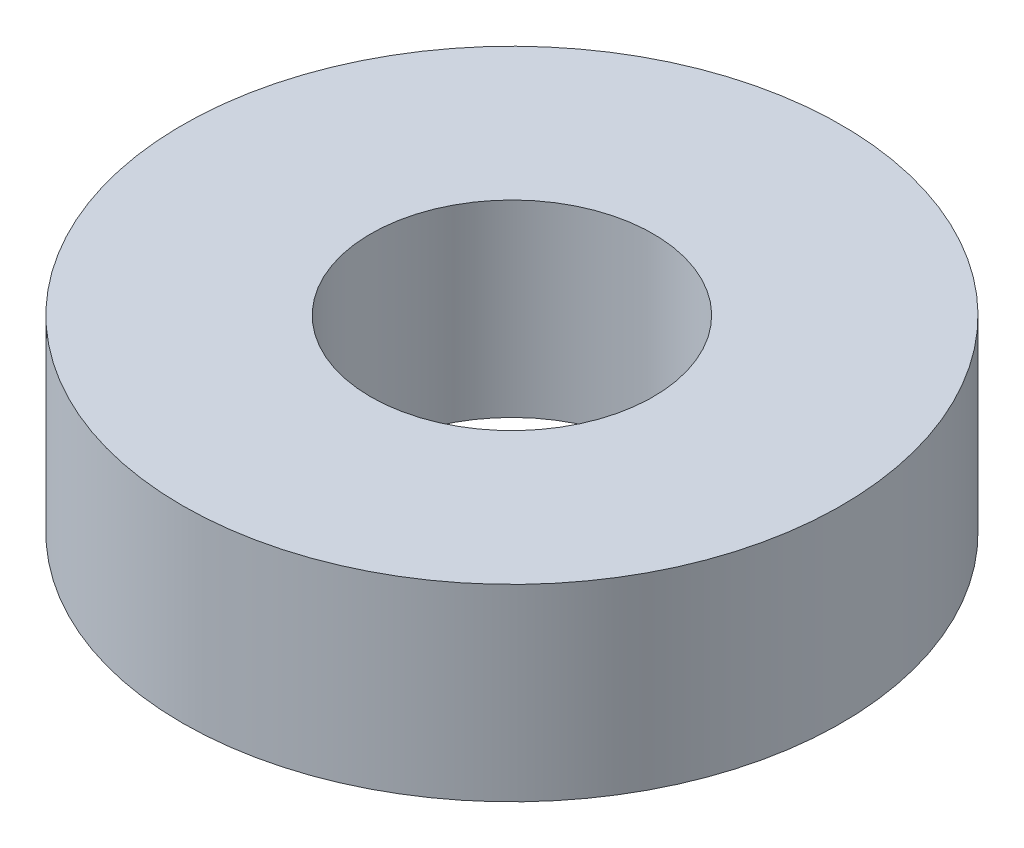
ISO-10303-21;
HEADER;
FILE_DESCRIPTION(('STEP AP214'),'2;1');
FILE_NAME('part.step','',(''),(''),'','','');
FILE_SCHEMA(('AUTOMOTIVE_DESIGN { 1 0 10303 214 1 1 1 1 }'));
ENDSEC;
DATA;
#1=APPLICATION_CONTEXT('core data for automotive mechanical design processes');
#2=APPLICATION_PROTOCOL_DEFINITION('international standard','automotive_design',2000,#1);
#3=PRODUCT_CONTEXT('',#1,'mechanical');
#4=PRODUCT('Part','Part','',(#3));
#5=PRODUCT_RELATED_PRODUCT_CATEGORY('part','',(#4));
#6=PRODUCT_DEFINITION_FORMATION('','',#4);
#7=PRODUCT_DEFINITION_CONTEXT('part definition',#1,'design');
#8=PRODUCT_DEFINITION('design','',#6,#7);
#9=PRODUCT_DEFINITION_SHAPE('','',#8);
#10=(LENGTH_UNIT() NAMED_UNIT(*) SI_UNIT(.MILLI.,.METRE.));
#11=(NAMED_UNIT(*) PLANE_ANGLE_UNIT() SI_UNIT($,.RADIAN.));
#12=(NAMED_UNIT(*) SI_UNIT($,.STERADIAN.) SOLID_ANGLE_UNIT());
#13=UNCERTAINTY_MEASURE_WITH_UNIT(LENGTH_MEASURE(1.E-05),#10,'distance_accuracy_value','');
#14=(GEOMETRIC_REPRESENTATION_CONTEXT(3) GLOBAL_UNCERTAINTY_ASSIGNED_CONTEXT((#13)) GLOBAL_UNIT_ASSIGNED_CONTEXT((#10,
#11,#12)) REPRESENTATION_CONTEXT('',''));
#15=CARTESIAN_POINT('',(0.,0.,0.));
#16=DIRECTION('',(0.,0.,1.));
#17=DIRECTION('',(1.,0.,0.));
#18=AXIS2_PLACEMENT_3D('',#15,#16,#17);
#19=CARTESIAN_POINT('',(0.,0.5,0.));
#20=DIRECTION('',(0.,1.,0.));
#21=DIRECTION('',(0.,0.,1.));
#22=AXIS2_PLACEMENT_3D('',#19,#20,#21);
#23=PLANE('',#22);
#24=CARTESIAN_POINT('',(0.,0.5,0.));
#25=DIRECTION('',(0.,1.,0.));
#26=DIRECTION('',(0.,0.,1.));
#27=AXIS2_PLACEMENT_3D('',#24,#25,#26);
#28=CIRCLE('',#27,0.875);
#29=CARTESIAN_POINT('',(0.,0.5,0.875));
#30=VERTEX_POINT('',#29);
#31=EDGE_CURVE('E10',#30,#30,#28,.T.);
#32=ORIENTED_EDGE('',*,*,#31,.T.);
#33=EDGE_LOOP('',(#32));
#34=FACE_BOUND('',#33,.T.);
#35=CARTESIAN_POINT('',(0.,0.5,0.));
#36=DIRECTION('',(0.,1.,0.));
#37=DIRECTION('',(0.,0.,1.));
#38=AXIS2_PLACEMENT_3D('',#35,#36,#37);
#39=CIRCLE('',#38,0.375);
#40=CARTESIAN_POINT('',(0.,0.5,0.375));
#41=VERTEX_POINT('',#40);
#42=EDGE_CURVE('E42',#41,#41,#39,.T.);
#43=ORIENTED_EDGE('',*,*,#42,.F.);
#44=EDGE_LOOP('',(#43));
#45=FACE_BOUND('',#44,.T.);
#46=ADVANCED_FACE('F31',(#34,#45),#23,.T.);
#47=CARTESIAN_POINT('',(0.,0.,0.));
#48=DIRECTION('',(0.,1.,0.));
#49=DIRECTION('',(0.,0.,1.));
#50=AXIS2_PLACEMENT_3D('',#47,#48,#49);
#51=PLANE('',#50);
#52=CARTESIAN_POINT('',(0.,0.,0.));
#53=DIRECTION('',(0.,1.,0.));
#54=DIRECTION('',(0.,0.,1.));
#55=AXIS2_PLACEMENT_3D('',#52,#53,#54);
#56=CIRCLE('',#55,0.875);
#57=CARTESIAN_POINT('',(0.,0.,0.875));
#58=VERTEX_POINT('',#57);
#59=EDGE_CURVE('E35',#58,#58,#56,.T.);
#60=ORIENTED_EDGE('',*,*,#59,.F.);
#61=EDGE_LOOP('',(#60));
#62=FACE_BOUND('',#61,.T.);
#63=CARTESIAN_POINT('',(0.,0.,0.));
#64=DIRECTION('',(0.,1.,0.));
#65=DIRECTION('',(0.,0.,1.));
#66=AXIS2_PLACEMENT_3D('',#63,#64,#65);
#67=CIRCLE('',#66,0.375);
#68=CARTESIAN_POINT('',(0.,0.,0.375));
#69=VERTEX_POINT('',#68);
#70=EDGE_CURVE('E44',#69,#69,#67,.T.);
#71=ORIENTED_EDGE('',*,*,#70,.T.);
#72=EDGE_LOOP('',(#71));
#73=FACE_BOUND('',#72,.T.);
#74=ADVANCED_FACE('F54',(#62,#73),#51,.F.);
#75=CARTESIAN_POINT('',(0.,0.5,0.));
#76=DIRECTION('',(0.,-1.,0.));
#77=DIRECTION('',(0.,0.,-1.));
#78=AXIS2_PLACEMENT_3D('',#75,#76,#77);
#79=CYLINDRICAL_SURFACE('',#78,0.875);
#80=ORIENTED_EDGE('',*,*,#31,.F.);
#81=EDGE_LOOP('',(#80));
#82=FACE_BOUND('',#81,.T.);
#83=ORIENTED_EDGE('',*,*,#59,.T.);
#84=EDGE_LOOP('',(#83));
#85=FACE_BOUND('',#84,.T.);
#86=ADVANCED_FACE('F33',(#82,#85),#79,.T.);
#87=CARTESIAN_POINT('',(0.,0.5,0.));
#88=DIRECTION('',(0.,-1.,0.));
#89=DIRECTION('',(0.,0.,-1.));
#90=AXIS2_PLACEMENT_3D('',#87,#88,#89);
#91=CYLINDRICAL_SURFACE('',#90,0.375);
#92=ORIENTED_EDGE('',*,*,#42,.T.);
#93=EDGE_LOOP('',(#92));
#94=FACE_BOUND('',#93,.T.);
#95=ORIENTED_EDGE('',*,*,#70,.F.);
#96=EDGE_LOOP('',(#95));
#97=FACE_BOUND('',#96,.T.);
#98=ADVANCED_FACE('F50',(#94,#97),#91,.F.);
#99=CLOSED_SHELL('',(#46,#74,#86,#98));
#100=MANIFOLD_SOLID_BREP('B2',#99);
#101=ADVANCED_BREP_SHAPE_REPRESENTATION('',(#18,#100),#14);
#102=SHAPE_DEFINITION_REPRESENTATION(#9,#101);
ENDSEC;
END-ISO-10303-21;
